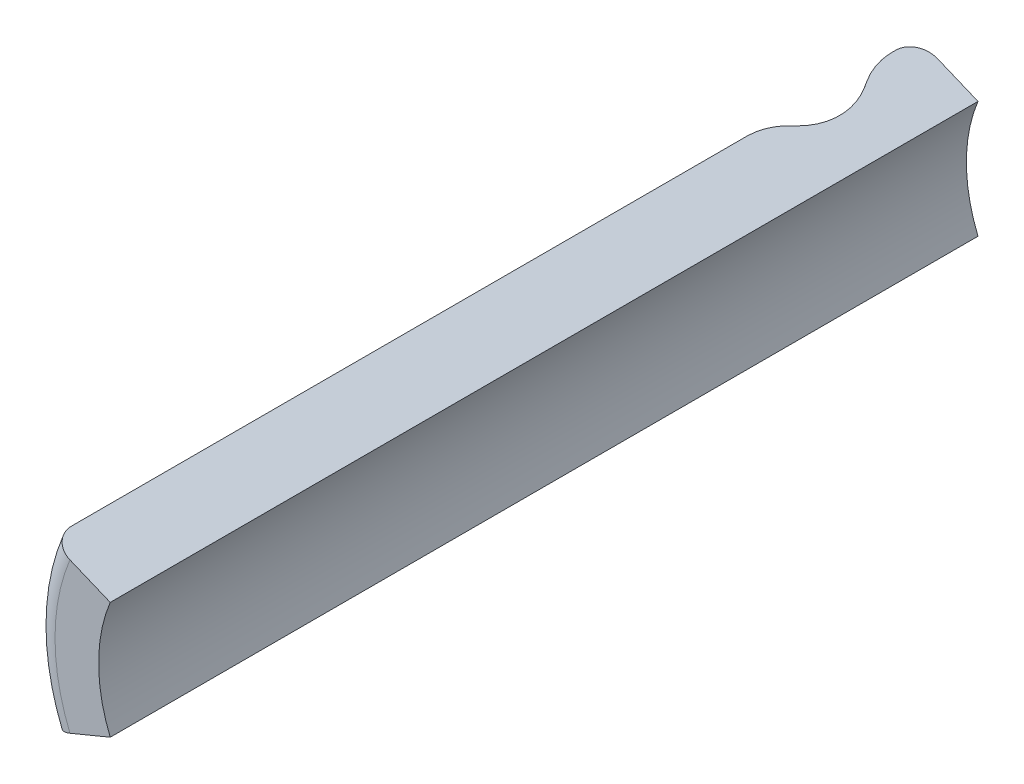
ISO-10303-21;
HEADER;
FILE_DESCRIPTION(('STEP AP214'),'2;1');
FILE_NAME('part.step','',(''),(''),'','','');
FILE_SCHEMA(('AUTOMOTIVE_DESIGN { 1 0 10303 214 1 1 1 1 }'));
ENDSEC;
DATA;
#1=APPLICATION_CONTEXT('core data for automotive mechanical design processes');
#2=APPLICATION_PROTOCOL_DEFINITION('international standard','automotive_design',2000,#1);
#3=PRODUCT_CONTEXT('',#1,'mechanical');
#4=PRODUCT('Part','Part','',(#3));
#5=PRODUCT_RELATED_PRODUCT_CATEGORY('part','',(#4));
#6=PRODUCT_DEFINITION_FORMATION('','',#4);
#7=PRODUCT_DEFINITION_CONTEXT('part definition',#1,'design');
#8=PRODUCT_DEFINITION('design','',#6,#7);
#9=PRODUCT_DEFINITION_SHAPE('','',#8);
#10=(LENGTH_UNIT() NAMED_UNIT(*) SI_UNIT(.MILLI.,.METRE.));
#11=(NAMED_UNIT(*) PLANE_ANGLE_UNIT() SI_UNIT($,.RADIAN.));
#12=(NAMED_UNIT(*) SI_UNIT($,.STERADIAN.) SOLID_ANGLE_UNIT());
#13=UNCERTAINTY_MEASURE_WITH_UNIT(LENGTH_MEASURE(1.E-05),#10,'distance_accuracy_value','');
#14=(GEOMETRIC_REPRESENTATION_CONTEXT(3) GLOBAL_UNCERTAINTY_ASSIGNED_CONTEXT((#13)) GLOBAL_UNIT_ASSIGNED_CONTEXT((#10,
#11,#12)) REPRESENTATION_CONTEXT('',''));
#15=CARTESIAN_POINT('',(0.,0.,0.));
#16=DIRECTION('',(0.,0.,1.));
#17=DIRECTION('',(1.,0.,0.));
#18=AXIS2_PLACEMENT_3D('',#15,#16,#17);
#19=CARTESIAN_POINT('',(0.,0.,0.66));
#20=DIRECTION('',(0.,0.,1.));
#21=DIRECTION('',(1.,0.,0.));
#22=AXIS2_PLACEMENT_3D('',#19,#20,#21);
#23=CYLINDRICAL_SURFACE('',#22,8.25);
#24=DIRECTION('',(0.,0.,1.));
#25=VECTOR('',#24,1.);
#26=CARTESIAN_POINT('',(-7.62200614321812,3.15713831701199,0.66));
#27=LINE('',#26,#25);
#28=CARTESIAN_POINT('',(-7.62200614321812,3.15713831701198,1.62446468675263));
#29=VERTEX_POINT('',#28);
#30=CARTESIAN_POINT('',(-7.62200614321812,3.15713831701198,1.485));
#31=VERTEX_POINT('',#30);
#32=EDGE_CURVE('E102',#29,#31,#27,.F.);
#33=ORIENTED_EDGE('',*,*,#32,.T.);
#34=CARTESIAN_POINT('',(0.,0.,1.485));
#35=DIRECTION('',(0.,0.,1.));
#36=DIRECTION('',(1.,0.,0.));
#37=AXIS2_PLACEMENT_3D('',#34,#35,#36);
#38=CIRCLE('',#37,8.25);
#39=CARTESIAN_POINT('',(-7.62200614321812,-3.15713831701198,1.485));
#40=VERTEX_POINT('',#39);
#41=EDGE_CURVE('E118',#40,#31,#38,.F.);
#42=ORIENTED_EDGE('',*,*,#41,.F.);
#43=DIRECTION('',(0.,0.,1.));
#44=VECTOR('',#43,1.);
#45=CARTESIAN_POINT('',(-7.62200614321812,-3.15713831701199,0.66));
#46=LINE('',#45,#44);
#47=CARTESIAN_POINT('',(-7.62200614321812,-3.15713831701198,1.62446468675263));
#48=VERTEX_POINT('',#47);
#49=EDGE_CURVE('E108',#40,#48,#46,.T.);
#50=ORIENTED_EDGE('',*,*,#49,.T.);
#51=CARTESIAN_POINT('',(0.,0.,1.62446468675263));
#52=DIRECTION('',(0.,0.,-1.));
#53=DIRECTION('',(1.,0.,0.));
#54=AXIS2_PLACEMENT_3D('',#51,#52,#53);
#55=CIRCLE('',#54,8.25);
#56=EDGE_CURVE('E159',#29,#48,#55,.F.);
#57=ORIENTED_EDGE('',*,*,#56,.F.);
#58=EDGE_LOOP('',(#33,#42,#50,#57));
#59=FACE_BOUND('',#58,.T.);
#60=ADVANCED_FACE('F17',(#59),#23,.T.);
#61=CARTESIAN_POINT('',(0.,0.,1.485));
#62=DIRECTION('',(0.,0.,1.));
#63=DIRECTION('',(1.,0.,0.));
#64=AXIS2_PLACEMENT_3D('',#61,#62,#63);
#65=TOROIDAL_SURFACE('',#64,7.425,0.825);
#66=CARTESIAN_POINT('',(-7.62200614321813,3.15713831701197,1.485));
#67=CARTESIAN_POINT('',(-7.62204256182288,3.15715340209199,1.43858690077819));
#68=CARTESIAN_POINT('',(-7.61838977789419,3.1556403694483,1.39218557898556));
#69=CARTESIAN_POINT('',(-7.60397454988172,3.14966938650084,1.30073102324611));
#70=CARTESIAN_POINT('',(-7.59321768404103,3.14521374678099,1.25567676055645));
#71=CARTESIAN_POINT('',(-7.5648554521704,3.13346572568101,1.1681429880569));
#72=CARTESIAN_POINT('',(-7.5472467977069,3.12617198218709,1.12566472589937));
#73=CARTESIAN_POINT('',(-7.50569620354202,3.10896116255933,1.04451771986299));
#74=CARTESIAN_POINT('',(-7.48175537952921,3.09904454855884,1.00584830653449));
#75=CARTESIAN_POINT('',(-7.42821320353762,3.07686665310416,0.933405071623154));
#76=CARTESIAN_POINT('',(-7.39861130772004,3.06460514638456,0.899631720935907));
#77=CARTESIAN_POINT('',(-7.33458880166737,3.03808615608043,0.837943980824093));
#78=CARTESIAN_POINT('',(-7.30016826911911,3.02382870467484,0.810029496960073));
#79=CARTESIAN_POINT('',(-7.22747906633709,2.99371985104443,0.760844503551425));
#80=CARTESIAN_POINT('',(-7.18920923901439,2.9778679695377,0.739575999710074));
#81=CARTESIAN_POINT('',(-7.10992142407508,2.9450258812589,0.704306217909735));
#82=CARTESIAN_POINT('',(-7.06890506199236,2.92803634780504,0.690300683551041));
#83=CARTESIAN_POINT('',(-6.99966567094382,2.89935645298228,0.673435012043788));
#84=CARTESIAN_POINT('',(-6.97187820912627,2.88784650943352,0.668399926773944));
#85=CARTESIAN_POINT('',(-6.91599955724885,2.86470081397877,0.66168286404564));
#86=CARTESIAN_POINT('',(-6.88790885478472,2.85306526404154,0.659996132962406));
#87=CARTESIAN_POINT('',(-6.85980552889633,2.84142448531078,0.66));
#88=B_SPLINE_CURVE_WITH_KNOTS('',3,(#66,#67,#68,#69,#70,#71,#72,#73,#74,#75,#76,#77,#78,#79,#80,
#81,#82,#83,#84,#85,#86,#87),.UNSPECIFIED.,.F.,.F.,(4,2,2,2,2,2,2,2,2,2,4),(0.,
0.139054322565422,0.277999586981286,0.417011618920024,0.555999174107767,0.695000088043242,
0.833998761241885,0.973039342697626,1.11199834829052,1.20331120693812,1.29449433666177),.UNSPECIFIED.);
#89=CARTESIAN_POINT('',(-6.85980552889631,2.84142448531079,0.66));
#90=VERTEX_POINT('',#89);
#91=EDGE_CURVE('E121',#31,#90,#88,.T.);
#92=ORIENTED_EDGE('',*,*,#91,.T.);
#93=CARTESIAN_POINT('',(0.,0.,0.66));
#94=DIRECTION('',(0.,0.,1.));
#95=DIRECTION('',(-0.923879532511287,0.38268343236509,0.));
#96=AXIS2_PLACEMENT_3D('',#93,#94,#95);
#97=CIRCLE('',#96,7.425);
#98=CARTESIAN_POINT('',(-6.85980552889631,-2.84142448531079,0.66));
#99=VERTEX_POINT('',#98);
#100=EDGE_CURVE('E125',#90,#99,#97,.T.);
#101=ORIENTED_EDGE('',*,*,#100,.T.);
#102=CARTESIAN_POINT('',(-6.85980552889631,-2.84142448531078,0.66));
#103=CARTESIAN_POINT('',(-6.90268564130775,-2.85918600942769,0.659960580786262));
#104=CARTESIAN_POINT('',(-6.94555487279344,-2.87694302651757,0.663914325620036));
#105=CARTESIAN_POINT('',(-7.03004786499603,-2.91194116981336,0.67951725598617));
#106=CARTESIAN_POINT('',(-7.07167257614739,-2.92918268970212,0.691160403671728));
#107=CARTESIAN_POINT('',(-7.15254323696323,-2.96268041421011,0.721859462231381));
#108=CARTESIAN_POINT('',(-7.19178803394722,-2.97893614137346,0.740918932480319));
#109=CARTESIAN_POINT('',(-7.2667580919488,-3.00998975616961,0.7858929715219));
#110=CARTESIAN_POINT('',(-7.30248397145722,-3.02478789998971,0.811806332701938));
#111=CARTESIAN_POINT('',(-7.36941279346071,-3.05251072577721,0.869759966381911));
#112=CARTESIAN_POINT('',(-7.40061530090498,-3.06543522754067,0.901800827528727));
#113=CARTESIAN_POINT('',(-7.45760734140116,-3.08904210366151,0.971098288723309));
#114=CARTESIAN_POINT('',(-7.48339696170374,-3.0997245141593,1.00835480468346));
#115=CARTESIAN_POINT('',(-7.5288379704207,-3.11854679625777,1.08703303082019));
#116=CARTESIAN_POINT('',(-7.54848750580686,-3.12668590030905,1.12845599342081));
#117=CARTESIAN_POINT('',(-7.58107253532833,-3.14018306146717,1.21427650588936));
#118=CARTESIAN_POINT('',(-7.59401196186421,-3.14554274742767,1.25867229629206));
#119=CARTESIAN_POINT('',(-7.60959381057182,-3.1519969604892,1.333616473116));
#120=CARTESIAN_POINT('',(-7.61424562279708,-3.15392380420251,1.36369340505324));
#121=CARTESIAN_POINT('',(-7.62045137957036,-3.15649431282279,1.42417602200821));
#122=CARTESIAN_POINT('',(-7.62200971589501,-3.1571397968632,1.45458117925612));
#123=CARTESIAN_POINT('',(-7.62200614321812,-3.15713831701199,1.48499999999999));
#124=B_SPLINE_CURVE_WITH_KNOTS('',3,(#102,#103,#104,#105,#106,#107,#108,#109,#110,#111,#112,
#113,#114,#115,#116,#117,#118,#119,#120,#121,#122,#123),.UNSPECIFIED.,.F.,.F.,(4,2,2,2,2,2,2,2,
2,2,4),(0.,0.13905432256542,0.277999586981285,0.417011618920023,0.555999174107764,
0.695000088043237,0.83399876124188,0.973039342697623,1.11199834829052,1.20331120693812,
1.29449433666177),.UNSPECIFIED.);
#125=EDGE_CURVE('E111',#99,#40,#124,.T.);
#126=ORIENTED_EDGE('',*,*,#125,.T.);
#127=ORIENTED_EDGE('',*,*,#41,.T.);
#128=EDGE_LOOP('',(#92,#101,#126,#127));
#129=FACE_BOUND('',#128,.T.);
#130=ADVANCED_FACE('F123',(#129),#65,.T.);
#131=CARTESIAN_POINT('',(0.,0.,1.62446468675263));
#132=DIRECTION('',(0.,0.,-1.));
#133=DIRECTION('',(1.,0.,0.));
#134=AXIS2_PLACEMENT_3D('',#131,#132,#133);
#135=TOROIDAL_SURFACE('',#134,5.775,2.475);
#136=CARTESIAN_POINT('',(-7.29614920451681,3.02216395360851,2.89784168143576));
#137=CARTESIAN_POINT('',(-7.32959862613637,3.03601915769687,2.83751440338843));
#138=CARTESIAN_POINT('',(-7.36065887081203,3.04888473229215,2.7756364129829));
#139=CARTESIAN_POINT('',(-7.417810131177,3.07255755944204,2.64922920039002));
#140=CARTESIAN_POINT('',(-7.44389994826097,3.08336431551805,2.58469934326148));
#141=CARTESIAN_POINT('',(-7.49038153195387,3.10261761788423,2.45492450615544));
#142=CARTESIAN_POINT('',(-7.51088691933286,3.11111122743832,2.38972719072762));
#143=CARTESIAN_POINT('',(-7.5468028239492,3.12598808223531,2.25773743006297));
#144=CARTESIAN_POINT('',(-7.56221518008407,3.1323720891745,2.19094556991511));
#145=CARTESIAN_POINT('',(-7.59052595214415,3.14409879492304,2.04209633392546));
#146=CARTESIAN_POINT('',(-7.60222399703514,3.14894428377013,1.9597684469408));
#147=CARTESIAN_POINT('',(-7.61802539438933,3.15548943685868,1.79312126799482));
#148=CARTESIAN_POINT('',(-7.62202236655024,3.15714503693616,1.7087901505208));
#149=CARTESIAN_POINT('',(-7.62200614321812,3.15713831701197,1.62446468675264));
#150=B_SPLINE_CURVE_WITH_KNOTS('',3,(#136,#137,#138,#139,#140,#141,#142,#143,#144,#145,#146,
#147,#148,#149),.UNSPECIFIED.,.F.,.F.,(4,2,2,2,2,2,4),(0.,0.211008075584621,0.422066970973275,
0.628441188520761,0.834740810658237,1.08419689867841,1.33707486560757),.UNSPECIFIED.);
#151=CARTESIAN_POINT('',(-7.29614920451681,3.02216395360852,2.89784168143576));
#152=VERTEX_POINT('',#151);
#153=EDGE_CURVE('E166',#152,#29,#150,.T.);
#154=ORIENTED_EDGE('',*,*,#153,.T.);
#155=ORIENTED_EDGE('',*,*,#56,.T.);
#156=CARTESIAN_POINT('',(-7.62200614321812,-3.15713831701198,1.62446468675263));
#157=CARTESIAN_POINT('',(-7.62201329398499,-3.1571412789566,1.69482242196139));
#158=CARTESIAN_POINT('',(-7.61923463906558,-3.15599032240383,1.765179382395));
#159=CARTESIAN_POINT('',(-7.60815603495956,-3.15140141433095,1.90539942074843));
#160=CARTESIAN_POINT('',(-7.59985475616942,-3.14796291207103,1.97526237563904));
#161=CARTESIAN_POINT('',(-7.57802623977233,-3.13892124453288,2.11242833256909));
#162=CARTESIAN_POINT('',(-7.56461908766232,-3.13336782029611,2.17975373643241));
#163=CARTESIAN_POINT('',(-7.5326777519397,-3.12013728583949,2.3129350938501));
#164=CARTESIAN_POINT('',(-7.51414542328028,-3.1124609439664,2.37879156975146));
#165=CARTESIAN_POINT('',(-7.46766889041409,-3.09320973372115,2.52219461467689));
#166=CARTESIAN_POINT('',(-7.43856679390817,-3.08115525065491,2.59930467503715));
#167=CARTESIAN_POINT('',(-7.37290362716102,-3.05395667643987,2.75100303208612));
#168=CARTESIAN_POINT('',(-7.33624571551737,-3.0387724722688,2.82554222734678));
#169=CARTESIAN_POINT('',(-7.29614920451681,-3.02216395360852,2.89784168143575));
#170=B_SPLINE_CURVE_WITH_KNOTS('',3,(#156,#157,#158,#159,#160,#161,#162,#163,#164,#165,#166,
#167,#168,#169),.UNSPECIFIED.,.F.,.F.,(4,2,2,2,2,2,4),(0.,0.211008075584621,0.422066970973275,
0.628441188520761,0.834740810658237,1.08419689867841,1.33707486560757),.UNSPECIFIED.);
#171=CARTESIAN_POINT('',(-7.29614920451681,-3.02216395360852,2.89784168143576));
#172=VERTEX_POINT('',#171);
#173=EDGE_CURVE('E114',#48,#172,#170,.T.);
#174=ORIENTED_EDGE('',*,*,#173,.T.);
#175=CARTESIAN_POINT('',(0.,0.,2.89784168143576));
#176=DIRECTION('',(0.,0.,-1.));
#177=DIRECTION('',(-1.,0.,0.));
#178=AXIS2_PLACEMENT_3D('',#175,#176,#177);
#179=CIRCLE('',#178,7.89729499113855);
#180=EDGE_CURVE('E155',#152,#172,#179,.F.);
#181=ORIENTED_EDGE('',*,*,#180,.F.);
#182=EDGE_LOOP('',(#154,#155,#174,#181));
#183=FACE_BOUND('',#182,.T.);
#184=ADVANCED_FACE('F146',(#183),#135,.T.);
#185=CARTESIAN_POINT('',(0.,0.,0.66));
#186=DIRECTION('',(0.,0.,1.));
#187=DIRECTION('',(1.,0.,0.));
#188=AXIS2_PLACEMENT_3D('',#185,#186,#187);
#189=PLANE('',#188);
#190=ORIENTED_EDGE('',*,*,#100,.F.);
#191=DIRECTION('',(-0.923879532511287,0.382683432365089,0.));
#192=VECTOR('',#191,1.);
#193=CARTESIAN_POINT('',(-5.33540430025268,2.20999682190839,0.66));
#194=LINE('',#193,#192);
#195=CARTESIAN_POINT('',(-5.33540430025268,2.20999682190838,0.66));
#196=VERTEX_POINT('',#195);
#197=EDGE_CURVE('E165',#196,#90,#194,.T.);
#198=ORIENTED_EDGE('',*,*,#197,.F.);
#199=CARTESIAN_POINT('',(0.,0.,0.66));
#200=DIRECTION('',(0.,0.,1.));
#201=DIRECTION('',(1.,0.,0.));
#202=AXIS2_PLACEMENT_3D('',#199,#200,#201);
#203=CIRCLE('',#202,5.775);
#204=CARTESIAN_POINT('',(-5.33540430025268,-2.20999682190839,0.66));
#205=VERTEX_POINT('',#204);
#206=EDGE_CURVE('E287',#196,#205,#203,.T.);
#207=ORIENTED_EDGE('',*,*,#206,.T.);
#208=DIRECTION('',(0.923879532511287,0.382683432365089,0.));
#209=VECTOR('',#208,1.);
#210=CARTESIAN_POINT('',(-6.85980552889631,-2.84142448531079,0.66));
#211=LINE('',#210,#209);
#212=EDGE_CURVE('E241',#99,#205,#211,.T.);
#213=ORIENTED_EDGE('',*,*,#212,.F.);
#214=EDGE_LOOP('',(#190,#198,#207,#213));
#215=FACE_BOUND('',#214,.T.);
#216=ADVANCED_FACE('F250',(#215),#189,.F.);
#217=CARTESIAN_POINT('',(0.,0.,2.89784168143576));
#218=DIRECTION('',(0.,0.,-1.));
#219=DIRECTION('',(-1.,0.,0.));
#220=AXIS2_PLACEMENT_3D('',#217,#218,#219);
#221=CONICAL_SURFACE('',#220,7.89729499113855,0.540419500270584);
#222=DIRECTION('',(0.475332098003425,-0.196889001624275,0.857492925712544));
#223=VECTOR('',#222,1.);
#224=CARTESIAN_POINT('',(-7.62200614321812,3.15713831701199,2.31));
#225=LINE('',#224,#223);
#226=CARTESIAN_POINT('',(-7.18457338727049,2.97594773687223,3.09912300531687));
#227=VERTEX_POINT('',#226);
#228=EDGE_CURVE('E240',#227,#152,#225,.F.);
#229=ORIENTED_EDGE('',*,*,#228,.T.);
#230=ORIENTED_EDGE('',*,*,#180,.T.);
#231=DIRECTION('',(0.475332098003425,0.196889001624275,0.857492925712544));
#232=VECTOR('',#231,1.);
#233=CARTESIAN_POINT('',(-7.62200614321812,-3.15713831701199,2.31));
#234=LINE('',#233,#232);
#235=CARTESIAN_POINT('',(-7.18457338727049,-2.97594773687224,3.09912300531687));
#236=VERTEX_POINT('',#235);
#237=EDGE_CURVE('E238',#172,#236,#234,.T.);
#238=ORIENTED_EDGE('',*,*,#237,.T.);
#239=CARTESIAN_POINT('',(0.,0.,3.09912300531687));
#240=DIRECTION('',(0.,0.,-1.));
#241=DIRECTION('',(1.,0.,0.));
#242=AXIS2_PLACEMENT_3D('',#239,#240,#241);
#243=CIRCLE('',#242,7.77652619680988);
#244=EDGE_CURVE('E307',#236,#227,#243,.T.);
#245=ORIENTED_EDGE('',*,*,#244,.T.);
#246=EDGE_LOOP('',(#229,#230,#238,#245));
#247=FACE_BOUND('',#246,.T.);
#248=ADVANCED_FACE('F259',(#247),#221,.T.);
#249=CARTESIAN_POINT('',(0.,0.,33.5));
#250=DIRECTION('',(0.,0.,1.));
#251=DIRECTION('',(1.,0.,0.));
#252=AXIS2_PLACEMENT_3D('',#249,#250,#251);
#253=PLANE('',#252);
#254=DIRECTION('',(-0.923879532511287,0.382683432365089,0.));
#255=VECTOR('',#254,1.);
#256=CARTESIAN_POINT('',(-5.33540430025268,2.20999682190839,33.5));
#257=LINE('',#256,#255);
#258=CARTESIAN_POINT('',(-5.33540430025268,2.20999682190838,33.5));
#259=VERTEX_POINT('',#258);
#260=CARTESIAN_POINT('',(-6.85980552889631,2.84142448531079,33.5));
#261=VERTEX_POINT('',#260);
#262=EDGE_CURVE('E277',#259,#261,#257,.T.);
#263=ORIENTED_EDGE('',*,*,#262,.T.);
#264=CARTESIAN_POINT('',(0.,0.,33.5));
#265=DIRECTION('',(0.,0.,-1.));
#266=DIRECTION('',(-0.923879532511287,-0.382683432365089,0.));
#267=AXIS2_PLACEMENT_3D('',#264,#265,#266);
#268=CIRCLE('',#267,7.42500000000001);
#269=CARTESIAN_POINT('',(-6.85980552889631,-2.84142448531079,33.5));
#270=VERTEX_POINT('',#269);
#271=EDGE_CURVE('E346',#270,#261,#268,.T.);
#272=ORIENTED_EDGE('',*,*,#271,.F.);
#273=DIRECTION('',(-0.923879532511287,-0.38268343236509,0.));
#274=VECTOR('',#273,1.);
#275=CARTESIAN_POINT('',(-14.7629551057445,-6.11501622550449,33.5));
#276=LINE('',#275,#274);
#277=CARTESIAN_POINT('',(-5.33540430025268,-2.20999682190838,33.5));
#278=VERTEX_POINT('',#277);
#279=EDGE_CURVE('E237',#270,#278,#276,.F.);
#280=ORIENTED_EDGE('',*,*,#279,.T.);
#281=CARTESIAN_POINT('',(0.,0.,33.5));
#282=DIRECTION('',(0.,0.,1.));
#283=DIRECTION('',(1.,0.,0.));
#284=AXIS2_PLACEMENT_3D('',#281,#282,#283);
#285=CIRCLE('',#284,5.775);
#286=EDGE_CURVE('E284',#278,#259,#285,.F.);
#287=ORIENTED_EDGE('',*,*,#286,.T.);
#288=EDGE_LOOP('',(#263,#272,#280,#287));
#289=FACE_BOUND('',#288,.T.);
#290=ADVANCED_FACE('F262',(#289),#253,.T.);
#291=CARTESIAN_POINT('',(0.,0.,-6.78604721240346));
#292=DIRECTION('',(0.,0.,1.));
#293=DIRECTION('',(1.,0.,0.));
#294=AXIS2_PLACEMENT_3D('',#291,#292,#293);
#295=CYLINDRICAL_SURFACE('',#294,5.775);
#296=ORIENTED_EDGE('',*,*,#206,.F.);
#297=DIRECTION('',(0.,0.,1.));
#298=VECTOR('',#297,1.);
#299=CARTESIAN_POINT('',(-5.33540430025269,2.20999682190837,-57.4860736596541));
#300=LINE('',#299,#298);
#301=EDGE_CURVE('E352',#196,#259,#300,.T.);
#302=ORIENTED_EDGE('',*,*,#301,.T.);
#303=ORIENTED_EDGE('',*,*,#286,.F.);
#304=DIRECTION('',(0.,0.,1.));
#305=VECTOR('',#304,1.);
#306=CARTESIAN_POINT('',(-5.33540430025268,-2.20999682190838,-57.4860736596541));
#307=LINE('',#306,#305);
#308=EDGE_CURVE('E228',#278,#205,#307,.F.);
#309=ORIENTED_EDGE('',*,*,#308,.T.);
#310=EDGE_LOOP('',(#296,#302,#303,#309));
#311=FACE_BOUND('',#310,.T.);
#312=ADVANCED_FACE('F267',(#311),#295,.F.);
#313=CARTESIAN_POINT('',(0.,0.,4.3725));
#314=DIRECTION('',(0.,0.,-1.));
#315=DIRECTION('',(1.,0.,0.));
#316=AXIS2_PLACEMENT_3D('',#313,#314,#315);
#317=TOROIDAL_SURFACE('',#316,9.89882118794842,2.475);
#318=CARTESIAN_POINT('',(0.,0.,5.64587699468313));
#319=DIRECTION('',(0.,0.,1.));
#320=DIRECTION('',(-1.,0.,0.));
#321=AXIS2_PLACEMENT_3D('',#318,#319,#320);
#322=CIRCLE('',#321,7.77652619680988);
#323=CARTESIAN_POINT('',(-7.1845733872705,2.97594773687222,5.64587699468313));
#324=VERTEX_POINT('',#323);
#325=CARTESIAN_POINT('',(-7.18457338727049,-2.97594773687223,5.64587699468313));
#326=VERTEX_POINT('',#325);
#327=EDGE_CURVE('E314',#324,#326,#322,.T.);
#328=ORIENTED_EDGE('',*,*,#327,.F.);
#329=CARTESIAN_POINT('',(-7.18457338727049,2.97594773687222,5.64587699468313));
#330=CARTESIAN_POINT('',(-7.15147343920666,2.96223728947034,5.58617812398875));
#331=CARTESIAN_POINT('',(-7.12071302558303,2.94949590896322,5.5249635378993));
#332=CARTESIAN_POINT('',(-7.06406412718098,2.9260311669516,5.39995132223574));
#333=CARTESIAN_POINT('',(-7.03817541675925,2.91530771198257,5.33615381246163));
#334=CARTESIAN_POINT('',(-6.99148465664248,2.89596776590469,5.20648787945577));
#335=CARTESIAN_POINT('',(-6.97067719786091,2.88734903427885,5.14062174338803));
#336=CARTESIAN_POINT('',(-6.93425953555619,2.87226434464231,5.00724740075713));
#337=CARTESIAN_POINT('',(-6.91864925369947,2.86579835418479,4.93973921895988));
#338=CARTESIAN_POINT('',(-6.87979191431389,2.84970311721355,4.73540170021029));
#339=CARTESIAN_POINT('',(-6.86449447100579,2.8433667087257,4.59669286092358));
#340=CARTESIAN_POINT('',(-6.85564178822191,2.83969980745323,4.31848300908768));
#341=CARTESIAN_POINT('',(-6.86209418124129,2.84237247615162,4.17898173560358));
#342=CARTESIAN_POINT('',(-6.89654328512692,2.85664176219264,3.90303561409497));
#343=CARTESIAN_POINT('',(-6.92455609825241,2.86824504930945,3.76659312892114));
#344=CARTESIAN_POINT('',(-7.00135259687821,2.90005520058302,3.50089490335449));
#345=CARTESIAN_POINT('',(-7.05009787310479,2.92024615509769,3.37162637054209));
#346=CARTESIAN_POINT('',(-7.12031883965201,2.9493326318045,3.22260544472921));
#347=CARTESIAN_POINT('',(-7.13262965395598,2.95443193805306,3.19755742496548));
#348=CARTESIAN_POINT('',(-7.15802275219003,2.96495010373228,3.14796715144671));
#349=CARTESIAN_POINT('',(-7.17110399215063,2.97036853073661,3.12342427143973));
#350=CARTESIAN_POINT('',(-7.18457338727049,2.97594773687222,3.09912300531687));
#351=B_SPLINE_CURVE_WITH_KNOTS('',3,(#329,#330,#331,#332,#333,#334,#335,#336,#337,#338,#339,
#340,#341,#342,#343,#344,#345,#346,#347,#348,#349,#350),.UNSPECIFIED.,.F.,.F.,(4,2,2,2,2,2,2,2,
2,2,4),(0.,0.208804889739494,0.417600105854582,0.626172077106107,0.834740904549245,
1.25166712330725,1.66873966586005,2.08612399893733,2.50273842472258,2.5878463339814,
2.67284145842631),.UNSPECIFIED.);
#352=EDGE_CURVE('E193',#324,#227,#351,.T.);
#353=ORIENTED_EDGE('',*,*,#352,.T.);
#354=ORIENTED_EDGE('',*,*,#244,.F.);
#355=CARTESIAN_POINT('',(-7.18457338727049,-2.97594773687223,3.09912300531687));
#356=CARTESIAN_POINT('',(-7.15147343920666,-2.96223728947035,3.15882187601125));
#357=CARTESIAN_POINT('',(-7.12071302558303,-2.94949590896323,3.22003646210071));
#358=CARTESIAN_POINT('',(-7.06406412718097,-2.92603116695161,3.34504867776426));
#359=CARTESIAN_POINT('',(-7.03817541675925,-2.91530771198258,3.40884618753837));
#360=CARTESIAN_POINT('',(-6.99148465664247,-2.8959677659047,3.53851212054423));
#361=CARTESIAN_POINT('',(-6.9706771978609,-2.88734903427886,3.60437825661197));
#362=CARTESIAN_POINT('',(-6.93425953555619,-2.87226434464232,3.73775259924287));
#363=CARTESIAN_POINT('',(-6.91864925369947,-2.8657983541848,3.80526078104012));
#364=CARTESIAN_POINT('',(-6.87979191431389,-2.84970311721356,4.00959829978971));
#365=CARTESIAN_POINT('',(-6.86449447100579,-2.84336670872571,4.14830713907642));
#366=CARTESIAN_POINT('',(-6.8556417882219,-2.83969980745324,4.42651699091232));
#367=CARTESIAN_POINT('',(-6.86209418124128,-2.84237247615163,4.56601826439642));
#368=CARTESIAN_POINT('',(-6.89654328512691,-2.85664176219265,4.84196438590503));
#369=CARTESIAN_POINT('',(-6.92455609825241,-2.86824504930946,4.97840687107887));
#370=CARTESIAN_POINT('',(-7.0013525968782,-2.90005520058303,5.24410509664552));
#371=CARTESIAN_POINT('',(-7.05009787310478,-2.9202461550977,5.37337362945792));
#372=CARTESIAN_POINT('',(-7.12031883965201,-2.94933263180451,5.52239455527079));
#373=CARTESIAN_POINT('',(-7.13262965395598,-2.95443193805307,5.54744257503452));
#374=CARTESIAN_POINT('',(-7.15802275219002,-2.96495010373228,5.59703284855329));
#375=CARTESIAN_POINT('',(-7.17110399215063,-2.97036853073662,5.62157572856028));
#376=CARTESIAN_POINT('',(-7.18457338727049,-2.97594773687223,5.64587699468313));
#377=B_SPLINE_CURVE_WITH_KNOTS('',3,(#355,#356,#357,#358,#359,#360,#361,#362,#363,#364,#365,
#366,#367,#368,#369,#370,#371,#372,#373,#374,#375,#376),.UNSPECIFIED.,.F.,.F.,(4,2,2,2,2,2,2,2,
2,2,4),(0.,0.208804889739494,0.417600105854582,0.626172077106106,0.834740904549246,
1.25166712330725,1.66873966586005,2.08612399893734,2.50273842472258,2.5878463339814,
2.67284145842631),.UNSPECIFIED.);
#378=EDGE_CURVE('E308',#236,#326,#377,.T.);
#379=ORIENTED_EDGE('',*,*,#378,.T.);
#380=EDGE_LOOP('',(#328,#353,#354,#379));
#381=FACE_BOUND('',#380,.T.);
#382=ADVANCED_FACE('F320',(#381),#317,.F.);
#383=CARTESIAN_POINT('',(0.,0.,5.84715831856425));
#384=DIRECTION('',(0.,0.,1.));
#385=DIRECTION('',(1.,0.,0.));
#386=AXIS2_PLACEMENT_3D('',#383,#384,#385);
#387=CONICAL_SURFACE('',#386,7.89729499113855,0.540419500270585);
#388=DIRECTION('',(0.475332098003398,-0.196889001624265,-0.857492925712562));
#389=VECTOR('',#388,1.);
#390=CARTESIAN_POINT('',(-7.29614920451682,3.02216395360851,5.84715831856426));
#391=LINE('',#390,#389);
#392=CARTESIAN_POINT('',(-7.29614920451681,3.02216395360851,5.84715831856425));
#393=VERTEX_POINT('',#392);
#394=EDGE_CURVE('E190',#393,#324,#391,.T.);
#395=ORIENTED_EDGE('',*,*,#394,.T.);
#396=ORIENTED_EDGE('',*,*,#327,.T.);
#397=DIRECTION('',(-0.475332098003398,-0.196889001624265,0.857492925712562));
#398=VECTOR('',#397,1.);
#399=CARTESIAN_POINT('',(-7.18457338727049,-2.97594773687223,5.64587699468313));
#400=LINE('',#399,#398);
#401=CARTESIAN_POINT('',(-7.29614920451681,-3.02216395360852,5.84715831856425));
#402=VERTEX_POINT('',#401);
#403=EDGE_CURVE('E313',#326,#402,#400,.T.);
#404=ORIENTED_EDGE('',*,*,#403,.T.);
#405=CARTESIAN_POINT('',(0.,0.,5.84715831856425));
#406=DIRECTION('',(0.,0.,1.));
#407=DIRECTION('',(1.,0.,0.));
#408=AXIS2_PLACEMENT_3D('',#405,#406,#407);
#409=CIRCLE('',#408,7.89729499113855);
#410=EDGE_CURVE('E173',#393,#402,#409,.T.);
#411=ORIENTED_EDGE('',*,*,#410,.F.);
#412=EDGE_LOOP('',(#395,#396,#404,#411));
#413=FACE_BOUND('',#412,.T.);
#414=ADVANCED_FACE('F324',(#413),#387,.T.);
#415=CARTESIAN_POINT('',(-14.7629551057445,-6.11501622550449,-57.4860736596541));
#416=DIRECTION('',(-0.38268343236509,0.923879532511287,0.));
#417=DIRECTION('',(-0.923879532511287,-0.38268343236509,0.));
#418=AXIS2_PLACEMENT_3D('',#415,#416,#417);
#419=PLANE('',#418);
#420=ORIENTED_EDGE('',*,*,#212,.T.);
#421=ORIENTED_EDGE('',*,*,#308,.F.);
#422=ORIENTED_EDGE('',*,*,#279,.F.);
#423=CARTESIAN_POINT('',(-7.62200614321812,-3.15713831701198,32.675));
#424=CARTESIAN_POINT('',(-7.62204256182288,-3.15715340209199,32.7214130992218));
#425=CARTESIAN_POINT('',(-7.61838977789418,-3.15564036944831,32.7678144210144));
#426=CARTESIAN_POINT('',(-7.60397454988171,-3.14966938650085,32.8592689767539));
#427=CARTESIAN_POINT('',(-7.59321768404102,-3.145213746781,32.9043232394436));
#428=CARTESIAN_POINT('',(-7.56485545217039,-3.13346572568102,32.9918570119431));
#429=CARTESIAN_POINT('',(-7.54724679770689,-3.1261719821871,33.0343352741006));
#430=CARTESIAN_POINT('',(-7.50569620354201,-3.10896116255934,33.115482280137));
#431=CARTESIAN_POINT('',(-7.4817553795292,-3.09904454855885,33.1541516934655));
#432=CARTESIAN_POINT('',(-7.42821320353762,-3.07686665310417,33.2265949283768));
#433=CARTESIAN_POINT('',(-7.39861130772004,-3.06460514638457,33.2603682790641));
#434=CARTESIAN_POINT('',(-7.33458880166738,-3.03808615608044,33.3220560191759));
#435=CARTESIAN_POINT('',(-7.30016826911911,-3.02382870467485,33.3499705030399));
#436=CARTESIAN_POINT('',(-7.22747906633709,-2.99371985104445,33.3991554964486));
#437=CARTESIAN_POINT('',(-7.18920923901439,-2.97786796953771,33.4204240002899));
#438=CARTESIAN_POINT('',(-7.10992142407507,-2.94502588125891,33.4556937820903));
#439=CARTESIAN_POINT('',(-7.06890506199236,-2.92803634780505,33.469699316449));
#440=CARTESIAN_POINT('',(-6.99966567094381,-2.89935645298229,33.4865649879562));
#441=CARTESIAN_POINT('',(-6.97187820912626,-2.88784650943353,33.4916000732261));
#442=CARTESIAN_POINT('',(-6.91599955724884,-2.86470081397878,33.4983171359544));
#443=CARTESIAN_POINT('',(-6.88790885478471,-2.85306526404155,33.5000038670376));
#444=CARTESIAN_POINT('',(-6.85980552889633,-2.84142448531078,33.5));
#445=B_SPLINE_CURVE_WITH_KNOTS('',3,(#423,#424,#425,#426,#427,#428,#429,#430,#431,#432,#433,
#434,#435,#436,#437,#438,#439,#440,#441,#442,#443,#444),.UNSPECIFIED.,.F.,.F.,(4,2,2,2,2,2,2,2,
2,2,4),(0.,0.139054322565421,0.277999586981286,0.417011618920016,0.555999174107758,
0.695000088043234,0.833998761241879,0.973039342697624,1.11199834829052,1.20331120693813,
1.29449433666177),.UNSPECIFIED.);
#446=CARTESIAN_POINT('',(-7.62200614321812,-3.15713831701198,32.675));
#447=VERTEX_POINT('',#446);
#448=EDGE_CURVE('E236',#447,#270,#445,.T.);
#449=ORIENTED_EDGE('',*,*,#448,.F.);
#450=DIRECTION('',(0.,0.,1.));
#451=VECTOR('',#450,1.);
#452=CARTESIAN_POINT('',(-7.62200614321812,-3.15713831701199,6.435));
#453=LINE('',#452,#451);
#454=CARTESIAN_POINT('',(-7.62200614321812,-3.15713831701199,7.12053531324737));
#455=VERTEX_POINT('',#454);
#456=EDGE_CURVE('E198',#455,#447,#453,.T.);
#457=ORIENTED_EDGE('',*,*,#456,.F.);
#458=CARTESIAN_POINT('',(-7.29614920451681,-3.02216395360852,5.84715831856425));
#459=CARTESIAN_POINT('',(-7.32959862613637,-3.03601915769688,5.90748559661158));
#460=CARTESIAN_POINT('',(-7.36065887081203,-3.04888473229216,5.96936358701711));
#461=CARTESIAN_POINT('',(-7.417810131177,-3.07255755944205,6.09577079960999));
#462=CARTESIAN_POINT('',(-7.44389994826096,-3.08336431551806,6.16030065673853));
#463=CARTESIAN_POINT('',(-7.49038153195387,-3.10261761788424,6.29007549384457));
#464=CARTESIAN_POINT('',(-7.51088691933286,-3.11111122743833,6.35527280927239));
#465=CARTESIAN_POINT('',(-7.54680282394919,-3.12598808223532,6.48726256993704));
#466=CARTESIAN_POINT('',(-7.56221518008407,-3.13237208917451,6.55405443008489));
#467=CARTESIAN_POINT('',(-7.59052595214415,-3.14409879492305,6.70290366607455));
#468=CARTESIAN_POINT('',(-7.60222399703513,-3.14894428377014,6.7852315530592));
#469=CARTESIAN_POINT('',(-7.61802539438933,-3.15548943685869,6.95187873200518));
#470=CARTESIAN_POINT('',(-7.62202236655024,-3.15714503693617,7.0362098494792));
#471=CARTESIAN_POINT('',(-7.62200614321812,-3.15713831701198,7.12053531324736));
#472=B_SPLINE_CURVE_WITH_KNOTS('',3,(#458,#459,#460,#461,#462,#463,#464,#465,#466,#467,#468,
#469,#470,#471),.UNSPECIFIED.,.F.,.F.,(4,2,2,2,2,2,4),(0.,0.21100807558462,0.422066970973274,
0.62844118852076,0.834740810658236,1.08419689867841,1.33707486560756),.UNSPECIFIED.);
#473=EDGE_CURVE('E174',#402,#455,#472,.T.);
#474=ORIENTED_EDGE('',*,*,#473,.F.);
#475=ORIENTED_EDGE('',*,*,#403,.F.);
#476=ORIENTED_EDGE('',*,*,#378,.F.);
#477=ORIENTED_EDGE('',*,*,#237,.F.);
#478=ORIENTED_EDGE('',*,*,#173,.F.);
#479=ORIENTED_EDGE('',*,*,#49,.F.);
#480=ORIENTED_EDGE('',*,*,#125,.F.);
#481=EDGE_LOOP('',(#420,#421,#422,#449,#457,#474,#475,#476,#477,#478,#479,#480));
#482=FACE_BOUND('',#481,.T.);
#483=ADVANCED_FACE('F109',(#482),#419,.F.);
#484=CARTESIAN_POINT('',(0.,0.,32.675));
#485=DIRECTION('',(0.,0.,-1.));
#486=DIRECTION('',(1.,0.,0.));
#487=AXIS2_PLACEMENT_3D('',#484,#485,#486);
#488=TOROIDAL_SURFACE('',#487,7.425,0.825);
#489=CARTESIAN_POINT('',(-6.85980552889632,2.84142448531077,33.5));
#490=CARTESIAN_POINT('',(-6.90268564130776,2.85918600942767,33.5000394192137));
#491=CARTESIAN_POINT('',(-6.94555487279345,2.87694302651756,33.49608567438));
#492=CARTESIAN_POINT('',(-7.03004786499604,2.91194116981336,33.4804827440138));
#493=CARTESIAN_POINT('',(-7.0716725761474,2.92918268970212,33.4688395963283));
#494=CARTESIAN_POINT('',(-7.15254323696323,2.96268041421011,33.4381405377686));
#495=CARTESIAN_POINT('',(-7.19178803394722,2.97893614137346,33.4190810675197));
#496=CARTESIAN_POINT('',(-7.2667580919488,3.00998975616961,33.3741070284781));
#497=CARTESIAN_POINT('',(-7.30248397145722,3.02478789998971,33.3481936672981));
#498=CARTESIAN_POINT('',(-7.36941279346071,3.05251072577721,33.2902400336181));
#499=CARTESIAN_POINT('',(-7.40061530090499,3.06543522754067,33.2581991724713));
#500=CARTESIAN_POINT('',(-7.45760734140117,3.0890421036615,33.1889017112767));
#501=CARTESIAN_POINT('',(-7.48339696170375,3.09972451415929,33.1516451953165));
#502=CARTESIAN_POINT('',(-7.5288379704207,3.11854679625776,33.0729669691798));
#503=CARTESIAN_POINT('',(-7.54848750580686,3.12668590030904,33.0315440065792));
#504=CARTESIAN_POINT('',(-7.58107253532833,3.14018306146716,32.9457234941106));
#505=CARTESIAN_POINT('',(-7.59401196186421,3.14554274742765,32.9013277037079));
#506=CARTESIAN_POINT('',(-7.60959381057182,3.15199696048919,32.826383526884));
#507=CARTESIAN_POINT('',(-7.61424562279708,3.15392380420251,32.7963065949468));
#508=CARTESIAN_POINT('',(-7.62045137957036,3.15649431282278,32.7358239779918));
#509=CARTESIAN_POINT('',(-7.62200971589501,3.15713979686319,32.7054188207439));
#510=CARTESIAN_POINT('',(-7.62200614321812,3.15713831701197,32.675));
#511=B_SPLINE_CURVE_WITH_KNOTS('',3,(#489,#490,#491,#492,#493,#494,#495,#496,#497,#498,#499,
#500,#501,#502,#503,#504,#505,#506,#507,#508,#509,#510),.UNSPECIFIED.,.F.,.F.,(4,2,2,2,2,2,2,2,
2,2,4),(0.,0.139054322565423,0.277999586981287,0.417011618920024,0.555999174107766,
0.695000088043239,0.833998761241883,0.973039342697624,1.11199834829052,1.20331120693813,
1.29449433666177),.UNSPECIFIED.);
#512=CARTESIAN_POINT('',(-7.62200614321812,3.15713831701198,32.675));
#513=VERTEX_POINT('',#512);
#514=EDGE_CURVE('E194',#261,#513,#511,.T.);
#515=ORIENTED_EDGE('',*,*,#514,.T.);
#516=CARTESIAN_POINT('',(0.,0.,32.675));
#517=DIRECTION('',(0.,0.,1.));
#518=DIRECTION('',(1.,0.,0.));
#519=AXIS2_PLACEMENT_3D('',#516,#517,#518);
#520=CIRCLE('',#519,8.25);
#521=EDGE_CURVE('E195',#447,#513,#520,.F.);
#522=ORIENTED_EDGE('',*,*,#521,.F.);
#523=ORIENTED_EDGE('',*,*,#448,.T.);
#524=ORIENTED_EDGE('',*,*,#271,.T.);
#525=EDGE_LOOP('',(#515,#522,#523,#524));
#526=FACE_BOUND('',#525,.T.);
#527=ADVANCED_FACE('F204',(#526),#488,.T.);
#528=CARTESIAN_POINT('',(-14.7629551057445,6.11501622550448,-57.4860736596541));
#529=DIRECTION('',(-0.38268343236509,-0.923879532511287,0.));
#530=DIRECTION('',(0.923879532511287,-0.38268343236509,0.));
#531=AXIS2_PLACEMENT_3D('',#528,#529,#530);
#532=PLANE('',#531);
#533=ORIENTED_EDGE('',*,*,#32,.F.);
#534=ORIENTED_EDGE('',*,*,#153,.F.);
#535=ORIENTED_EDGE('',*,*,#228,.F.);
#536=ORIENTED_EDGE('',*,*,#352,.F.);
#537=ORIENTED_EDGE('',*,*,#394,.F.);
#538=CARTESIAN_POINT('',(-7.62200614321813,3.15713831701197,7.12053531324737));
#539=CARTESIAN_POINT('',(-7.622013293985,3.15714127895659,7.05017757803861));
#540=CARTESIAN_POINT('',(-7.61923463906558,3.15599032240382,6.979820617605));
#541=CARTESIAN_POINT('',(-7.60815603495956,3.15140141433094,6.83960057925157));
#542=CARTESIAN_POINT('',(-7.59985475616942,3.14796291207102,6.76973762436096));
#543=CARTESIAN_POINT('',(-7.57802623977234,3.13892124453287,6.63257166743091));
#544=CARTESIAN_POINT('',(-7.56461908766232,3.1333678202961,6.56524626356759));
#545=CARTESIAN_POINT('',(-7.5326777519397,3.12013728583948,6.4320649061499));
#546=CARTESIAN_POINT('',(-7.51414542328029,3.11246094396639,6.36620843024854));
#547=CARTESIAN_POINT('',(-7.4676688904141,3.09320973372114,6.22280538532311));
#548=CARTESIAN_POINT('',(-7.43856679390818,3.08115525065489,6.14569532496285));
#549=CARTESIAN_POINT('',(-7.37290362716102,3.05395667643986,5.99399696791389));
#550=CARTESIAN_POINT('',(-7.33624571551737,3.03877247226879,5.91945777265323));
#551=CARTESIAN_POINT('',(-7.29614920451682,3.02216395360851,5.84715831856426));
#552=B_SPLINE_CURVE_WITH_KNOTS('',3,(#538,#539,#540,#541,#542,#543,#544,#545,#546,#547,#548,
#549,#550,#551),.UNSPECIFIED.,.F.,.F.,(4,2,2,2,2,2,4),(0.,0.211008075584621,0.422066970973275,
0.628441188520759,0.834740810658236,1.08419689867841,1.33707486560756),.UNSPECIFIED.);
#553=CARTESIAN_POINT('',(-7.62200614321812,3.15713831701198,7.12053531324737));
#554=VERTEX_POINT('',#553);
#555=EDGE_CURVE('E40',#554,#393,#552,.T.);
#556=ORIENTED_EDGE('',*,*,#555,.F.);
#557=DIRECTION('',(0.,0.,1.));
#558=VECTOR('',#557,1.);
#559=CARTESIAN_POINT('',(-7.62200614321812,3.15713831701199,6.435));
#560=LINE('',#559,#558);
#561=EDGE_CURVE('E31',#513,#554,#560,.F.);
#562=ORIENTED_EDGE('',*,*,#561,.F.);
#563=ORIENTED_EDGE('',*,*,#514,.F.);
#564=ORIENTED_EDGE('',*,*,#262,.F.);
#565=ORIENTED_EDGE('',*,*,#301,.F.);
#566=ORIENTED_EDGE('',*,*,#197,.T.);
#567=ORIENTED_EDGE('',*,*,#91,.F.);
#568=EDGE_LOOP('',(#533,#534,#535,#536,#537,#556,#562,#563,#564,#565,#566,#567));
#569=FACE_BOUND('',#568,.T.);
#570=ADVANCED_FACE('F138',(#569),#532,.F.);
#571=CARTESIAN_POINT('',(0.,0.,7.12053531324738));
#572=DIRECTION('',(0.,0.,1.));
#573=DIRECTION('',(1.,0.,0.));
#574=AXIS2_PLACEMENT_3D('',#571,#572,#573);
#575=TOROIDAL_SURFACE('',#574,5.775,2.475);
#576=ORIENTED_EDGE('',*,*,#555,.T.);
#577=ORIENTED_EDGE('',*,*,#410,.T.);
#578=ORIENTED_EDGE('',*,*,#473,.T.);
#579=CARTESIAN_POINT('',(0.,0.,7.12053531324737));
#580=DIRECTION('',(0.,0.,1.));
#581=DIRECTION('',(1.,0.,0.));
#582=AXIS2_PLACEMENT_3D('',#579,#580,#581);
#583=CIRCLE('',#582,8.25);
#584=EDGE_CURVE('E11',#554,#455,#583,.T.);
#585=ORIENTED_EDGE('',*,*,#584,.F.);
#586=EDGE_LOOP('',(#576,#577,#578,#585));
#587=FACE_BOUND('',#586,.T.);
#588=ADVANCED_FACE('F180',(#587),#575,.T.);
#589=CARTESIAN_POINT('',(0.,0.,6.435));
#590=DIRECTION('',(0.,0.,1.));
#591=DIRECTION('',(1.,0.,0.));
#592=AXIS2_PLACEMENT_3D('',#589,#590,#591);
#593=CYLINDRICAL_SURFACE('',#592,8.25);
#594=ORIENTED_EDGE('',*,*,#561,.T.);
#595=ORIENTED_EDGE('',*,*,#584,.T.);
#596=ORIENTED_EDGE('',*,*,#456,.T.);
#597=ORIENTED_EDGE('',*,*,#521,.T.);
#598=EDGE_LOOP('',(#594,#595,#596,#597));
#599=FACE_BOUND('',#598,.T.);
#600=ADVANCED_FACE('F185',(#599),#593,.T.);
#601=CLOSED_SHELL('',(#60,#130,#184,#216,#248,#290,#312,#382,#414,#483,#527,#570,#588,#600));
#602=MANIFOLD_SOLID_BREP('B1',#601);
#603=ADVANCED_BREP_SHAPE_REPRESENTATION('',(#18,#602),#14);
#604=SHAPE_DEFINITION_REPRESENTATION(#9,#603);
ENDSEC;
END-ISO-10303-21;
